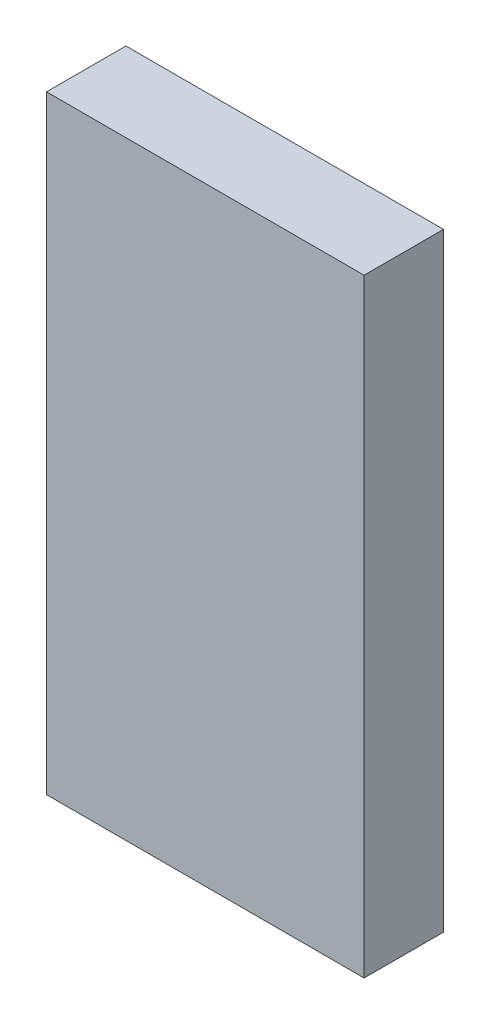
ISO-10303-21;
HEADER;
FILE_DESCRIPTION(('STEP AP214'),'2;1');
FILE_NAME('part.step','',(''),(''),'','','');
FILE_SCHEMA(('AUTOMOTIVE_DESIGN { 1 0 10303 214 1 1 1 1 }'));
ENDSEC;
DATA;
#1=APPLICATION_CONTEXT('core data for automotive mechanical design processes');
#2=APPLICATION_PROTOCOL_DEFINITION('international standard','automotive_design',2000,#1);
#3=PRODUCT_CONTEXT('',#1,'mechanical');
#4=PRODUCT('Part','Part','',(#3));
#5=PRODUCT_RELATED_PRODUCT_CATEGORY('part','',(#4));
#6=PRODUCT_DEFINITION_FORMATION('','',#4);
#7=PRODUCT_DEFINITION_CONTEXT('part definition',#1,'design');
#8=PRODUCT_DEFINITION('design','',#6,#7);
#9=PRODUCT_DEFINITION_SHAPE('','',#8);
#10=(LENGTH_UNIT() NAMED_UNIT(*) SI_UNIT(.MILLI.,.METRE.));
#11=(NAMED_UNIT(*) PLANE_ANGLE_UNIT() SI_UNIT($,.RADIAN.));
#12=(NAMED_UNIT(*) SI_UNIT($,.STERADIAN.) SOLID_ANGLE_UNIT());
#13=UNCERTAINTY_MEASURE_WITH_UNIT(LENGTH_MEASURE(1.E-05),#10,'distance_accuracy_value','');
#14=(GEOMETRIC_REPRESENTATION_CONTEXT(3) GLOBAL_UNCERTAINTY_ASSIGNED_CONTEXT((#13)) GLOBAL_UNIT_ASSIGNED_CONTEXT((#10,
#11,#12)) REPRESENTATION_CONTEXT('',''));
#15=CARTESIAN_POINT('',(0.,0.,0.));
#16=DIRECTION('',(0.,0.,1.));
#17=DIRECTION('',(1.,0.,0.));
#18=AXIS2_PLACEMENT_3D('',#15,#16,#17);
#19=CARTESIAN_POINT('',(1.269999998521E-06,0.,0.2999994));
#20=DIRECTION('',(0.,0.,1.));
#21=DIRECTION('',(1.,0.,0.));
#22=AXIS2_PLACEMENT_3D('',#19,#20,#21);
#23=PLANE('',#22);
#24=DIRECTION('',(0.,1.,0.));
#25=VECTOR('',#24,1.);
#26=CARTESIAN_POINT('',(0.60004198,-1.15000024,0.2999994));
#27=LINE('',#26,#25);
#28=CARTESIAN_POINT('',(0.60004198,-1.15000024,0.2999994));
#29=VERTEX_POINT('',#28);
#30=CARTESIAN_POINT('',(0.60004198,1.15000024,0.2999994));
#31=VERTEX_POINT('',#30);
#32=EDGE_CURVE('E80',#29,#31,#27,.T.);
#33=ORIENTED_EDGE('',*,*,#32,.T.);
#34=DIRECTION('',(-1.,0.,0.));
#35=VECTOR('',#34,1.);
#36=CARTESIAN_POINT('',(0.60004198,1.15000024,0.2999994));
#37=LINE('',#36,#35);
#38=CARTESIAN_POINT('',(-0.60003944,1.15000024,0.2999994));
#39=VERTEX_POINT('',#38);
#40=EDGE_CURVE('E20',#31,#39,#37,.T.);
#41=ORIENTED_EDGE('',*,*,#40,.T.);
#42=DIRECTION('',(0.,-1.,0.));
#43=VECTOR('',#42,1.);
#44=CARTESIAN_POINT('',(-0.60003944,1.15000024,0.2999994));
#45=LINE('',#44,#43);
#46=CARTESIAN_POINT('',(-0.60003944,-1.15000024,0.2999994));
#47=VERTEX_POINT('',#46);
#48=EDGE_CURVE('E105',#39,#47,#45,.T.);
#49=ORIENTED_EDGE('',*,*,#48,.T.);
#50=DIRECTION('',(1.,0.,0.));
#51=VECTOR('',#50,1.);
#52=CARTESIAN_POINT('',(-0.60003944,-1.15000024,0.2999994));
#53=LINE('',#52,#51);
#54=EDGE_CURVE('E11',#47,#29,#53,.T.);
#55=ORIENTED_EDGE('',*,*,#54,.T.);
#56=EDGE_LOOP('',(#33,#41,#49,#55));
#57=FACE_BOUND('',#56,.T.);
#58=ADVANCED_FACE('F16',(#57),#23,.T.);
#59=CARTESIAN_POINT('',(1.269999998521E-06,0.,0.));
#60=DIRECTION('',(0.,0.,1.));
#61=DIRECTION('',(1.,0.,0.));
#62=AXIS2_PLACEMENT_3D('',#59,#60,#61);
#63=PLANE('',#62);
#64=DIRECTION('',(0.,1.,0.));
#65=VECTOR('',#64,1.);
#66=CARTESIAN_POINT('',(0.60004198,-1.15000024,0.));
#67=LINE('',#66,#65);
#68=CARTESIAN_POINT('',(0.60004198,-1.15000024,0.));
#69=VERTEX_POINT('',#68);
#70=CARTESIAN_POINT('',(0.60004198,1.15000024,0.));
#71=VERTEX_POINT('',#70);
#72=EDGE_CURVE('E87',#69,#71,#67,.T.);
#73=ORIENTED_EDGE('',*,*,#72,.F.);
#74=DIRECTION('',(1.,0.,0.));
#75=VECTOR('',#74,1.);
#76=CARTESIAN_POINT('',(-0.60003944,-1.15000024,0.));
#77=LINE('',#76,#75);
#78=CARTESIAN_POINT('',(-0.60003944,-1.15000024,0.));
#79=VERTEX_POINT('',#78);
#80=EDGE_CURVE('E27',#79,#69,#77,.T.);
#81=ORIENTED_EDGE('',*,*,#80,.F.);
#82=DIRECTION('',(0.,-1.,0.));
#83=VECTOR('',#82,1.);
#84=CARTESIAN_POINT('',(-0.60003944,1.15000024,0.));
#85=LINE('',#84,#83);
#86=CARTESIAN_POINT('',(-0.60003944,1.15000024,0.));
#87=VERTEX_POINT('',#86);
#88=EDGE_CURVE('E78',#87,#79,#85,.T.);
#89=ORIENTED_EDGE('',*,*,#88,.F.);
#90=DIRECTION('',(-1.,0.,0.));
#91=VECTOR('',#90,1.);
#92=CARTESIAN_POINT('',(0.60004198,1.15000024,0.));
#93=LINE('',#92,#91);
#94=EDGE_CURVE('E84',#71,#87,#93,.T.);
#95=ORIENTED_EDGE('',*,*,#94,.F.);
#96=EDGE_LOOP('',(#73,#81,#89,#95));
#97=FACE_BOUND('',#96,.T.);
#98=ADVANCED_FACE('F115',(#97),#63,.F.);
#99=CARTESIAN_POINT('',(-0.60003944,-1.15000024,0.));
#100=DIRECTION('',(0.,1.,0.));
#101=DIRECTION('',(1.,0.,0.));
#102=AXIS2_PLACEMENT_3D('',#99,#100,#101);
#103=PLANE('',#102);
#104=DIRECTION('',(0.,0.,1.));
#105=VECTOR('',#104,1.);
#106=CARTESIAN_POINT('',(-0.60003944,-1.15000024,0.));
#107=LINE('',#106,#105);
#108=EDGE_CURVE('E101',#79,#47,#107,.T.);
#109=ORIENTED_EDGE('',*,*,#108,.F.);
#110=ORIENTED_EDGE('',*,*,#80,.T.);
#111=DIRECTION('',(0.,0.,1.));
#112=VECTOR('',#111,1.);
#113=CARTESIAN_POINT('',(0.60004198,-1.15000024,0.));
#114=LINE('',#113,#112);
#115=EDGE_CURVE('E94',#69,#29,#114,.T.);
#116=ORIENTED_EDGE('',*,*,#115,.T.);
#117=ORIENTED_EDGE('',*,*,#54,.F.);
#118=EDGE_LOOP('',(#109,#110,#116,#117));
#119=FACE_BOUND('',#118,.T.);
#120=ADVANCED_FACE('F113',(#119),#103,.F.);
#121=CARTESIAN_POINT('',(-0.60003944,1.15000024,0.));
#122=DIRECTION('',(1.,0.,0.));
#123=DIRECTION('',(0.,1.,0.));
#124=AXIS2_PLACEMENT_3D('',#121,#122,#123);
#125=PLANE('',#124);
#126=DIRECTION('',(0.,0.,1.));
#127=VECTOR('',#126,1.);
#128=CARTESIAN_POINT('',(-0.60003944,1.15000024,0.));
#129=LINE('',#128,#127);
#130=EDGE_CURVE('E75',#87,#39,#129,.T.);
#131=ORIENTED_EDGE('',*,*,#130,.F.);
#132=ORIENTED_EDGE('',*,*,#88,.T.);
#133=ORIENTED_EDGE('',*,*,#108,.T.);
#134=ORIENTED_EDGE('',*,*,#48,.F.);
#135=EDGE_LOOP('',(#131,#132,#133,#134));
#136=FACE_BOUND('',#135,.T.);
#137=ADVANCED_FACE('F112',(#136),#125,.F.);
#138=CARTESIAN_POINT('',(0.60004198,1.15000024,0.));
#139=DIRECTION('',(0.,-1.,0.));
#140=DIRECTION('',(0.,0.,-1.));
#141=AXIS2_PLACEMENT_3D('',#138,#139,#140);
#142=PLANE('',#141);
#143=DIRECTION('',(0.,0.,1.));
#144=VECTOR('',#143,1.);
#145=CARTESIAN_POINT('',(0.60004198,1.15000024,0.));
#146=LINE('',#145,#144);
#147=EDGE_CURVE('E72',#71,#31,#146,.T.);
#148=ORIENTED_EDGE('',*,*,#147,.F.);
#149=ORIENTED_EDGE('',*,*,#94,.T.);
#150=ORIENTED_EDGE('',*,*,#130,.T.);
#151=ORIENTED_EDGE('',*,*,#40,.F.);
#152=EDGE_LOOP('',(#148,#149,#150,#151));
#153=FACE_BOUND('',#152,.T.);
#154=ADVANCED_FACE('F69',(#153),#142,.F.);
#155=CARTESIAN_POINT('',(0.60004198,-1.15000024,0.));
#156=DIRECTION('',(-1.,0.,0.));
#157=DIRECTION('',(0.,0.,1.));
#158=AXIS2_PLACEMENT_3D('',#155,#156,#157);
#159=PLANE('',#158);
#160=ORIENTED_EDGE('',*,*,#115,.F.);
#161=ORIENTED_EDGE('',*,*,#72,.T.);
#162=ORIENTED_EDGE('',*,*,#147,.T.);
#163=ORIENTED_EDGE('',*,*,#32,.F.);
#164=EDGE_LOOP('',(#160,#161,#162,#163));
#165=FACE_BOUND('',#164,.T.);
#166=ADVANCED_FACE('F18',(#165),#159,.F.);
#167=CLOSED_SHELL('',(#58,#98,#120,#137,#154,#166));
#168=MANIFOLD_SOLID_BREP('B1',#167);
#169=ADVANCED_BREP_SHAPE_REPRESENTATION('',(#18,#168),#14);
#170=SHAPE_DEFINITION_REPRESENTATION(#9,#169);
ENDSEC;
END-ISO-10303-21;
